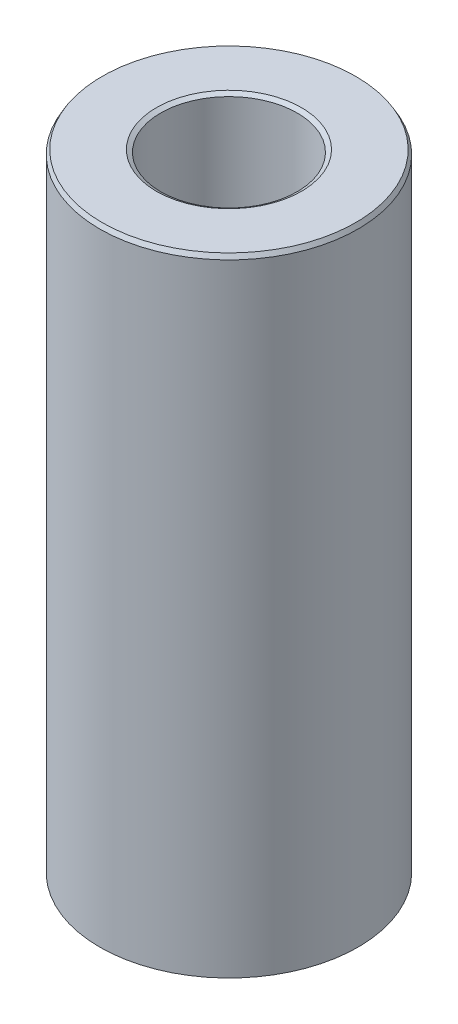
ISO-10303-21;
HEADER;
FILE_DESCRIPTION(('STEP AP214'),'2;1');
FILE_NAME('part.step','',(''),(''),'','','');
FILE_SCHEMA(('AUTOMOTIVE_DESIGN { 1 0 10303 214 1 1 1 1 }'));
ENDSEC;
DATA;
#1=APPLICATION_CONTEXT('core data for automotive mechanical design processes');
#2=APPLICATION_PROTOCOL_DEFINITION('international standard','automotive_design',2000,#1);
#3=PRODUCT_CONTEXT('',#1,'mechanical');
#4=PRODUCT('Part','Part','',(#3));
#5=PRODUCT_RELATED_PRODUCT_CATEGORY('part','',(#4));
#6=PRODUCT_DEFINITION_FORMATION('','',#4);
#7=PRODUCT_DEFINITION_CONTEXT('part definition',#1,'design');
#8=PRODUCT_DEFINITION('design','',#6,#7);
#9=PRODUCT_DEFINITION_SHAPE('','',#8);
#10=(LENGTH_UNIT() NAMED_UNIT(*) SI_UNIT(.MILLI.,.METRE.));
#11=(NAMED_UNIT(*) PLANE_ANGLE_UNIT() SI_UNIT($,.RADIAN.));
#12=(NAMED_UNIT(*) SI_UNIT($,.STERADIAN.) SOLID_ANGLE_UNIT());
#13=UNCERTAINTY_MEASURE_WITH_UNIT(LENGTH_MEASURE(1.E-05),#10,'distance_accuracy_value','');
#14=(GEOMETRIC_REPRESENTATION_CONTEXT(3) GLOBAL_UNCERTAINTY_ASSIGNED_CONTEXT((#13)) GLOBAL_UNIT_ASSIGNED_CONTEXT((#10,
#11,#12)) REPRESENTATION_CONTEXT('',''));
#15=CARTESIAN_POINT('',(0.,0.,0.));
#16=DIRECTION('',(0.,0.,1.));
#17=DIRECTION('',(1.,0.,0.));
#18=AXIS2_PLACEMENT_3D('',#15,#16,#17);
#19=CARTESIAN_POINT('',(0.,85.1411942310435,0.));
#20=DIRECTION('',(0.,-1.,0.));
#21=DIRECTION('',(0.,0.,-1.));
#22=AXIS2_PLACEMENT_3D('',#19,#20,#21);
#23=CYLINDRICAL_SURFACE('',#22,17.5);
#24=CARTESIAN_POINT('',(0.,0.335889421968369,0.));
#25=DIRECTION('',(0.,1.,0.));
#26=DIRECTION('',(0.,0.,1.));
#27=AXIS2_PLACEMENT_3D('',#24,#25,#26);
#28=CIRCLE('',#27,17.5);
#29=CARTESIAN_POINT('',(0.,0.335889421968369,17.5));
#30=VERTEX_POINT('',#29);
#31=EDGE_CURVE('E10',#30,#30,#28,.T.);
#32=ORIENTED_EDGE('',*,*,#31,.T.);
#33=EDGE_LOOP('',(#32));
#34=FACE_BOUND('',#33,.T.);
#35=CARTESIAN_POINT('',(0.,84.5594166864693,0.));
#36=DIRECTION('',(0.,1.,0.));
#37=DIRECTION('',(0.,0.,1.));
#38=AXIS2_PLACEMENT_3D('',#35,#36,#37);
#39=CIRCLE('',#38,17.5);
#40=CARTESIAN_POINT('',(0.,84.5594166864693,17.5));
#41=VERTEX_POINT('',#40);
#42=EDGE_CURVE('E50',#41,#41,#39,.F.);
#43=ORIENTED_EDGE('',*,*,#42,.T.);
#44=EDGE_LOOP('',(#43));
#45=FACE_BOUND('',#44,.T.);
#46=ADVANCED_FACE('F39',(#34,#45),#23,.T.);
#47=CARTESIAN_POINT('',(0.,85.1411942310435,0.));
#48=DIRECTION('',(0.,1.,0.));
#49=DIRECTION('',(0.,0.,1.));
#50=AXIS2_PLACEMENT_3D('',#47,#48,#49);
#51=PLANE('',#50);
#52=CARTESIAN_POINT('',(0.,85.1411942310435,0.));
#53=DIRECTION('',(0.,1.,0.));
#54=DIRECTION('',(0.,0.,1.));
#55=AXIS2_PLACEMENT_3D('',#52,#53,#54);
#56=CIRCLE('',#55,9.82578527081704);
#57=CARTESIAN_POINT('',(0.,85.1411942310435,9.82578527081704));
#58=VERTEX_POINT('',#57);
#59=EDGE_CURVE('E58',#58,#58,#56,.F.);
#60=ORIENTED_EDGE('',*,*,#59,.T.);
#61=EDGE_LOOP('',(#60));
#62=FACE_BOUND('',#61,.T.);
#63=CARTESIAN_POINT('',(0.,85.1411942310435,0.));
#64=DIRECTION('',(0.,1.,0.));
#65=DIRECTION('',(0.,0.,1.));
#66=AXIS2_PLACEMENT_3D('',#63,#64,#65);
#67=CIRCLE('',#66,17.1641105780316);
#68=CARTESIAN_POINT('',(0.,85.1411942310435,17.1641105780316));
#69=VERTEX_POINT('',#68);
#70=EDGE_CURVE('E61',#69,#69,#67,.T.);
#71=ORIENTED_EDGE('',*,*,#70,.T.);
#72=EDGE_LOOP('',(#71));
#73=FACE_BOUND('',#72,.T.);
#74=ADVANCED_FACE('F88',(#62,#73),#51,.T.);
#75=CARTESIAN_POINT('',(0.,0.,0.));
#76=DIRECTION('',(0.,1.,0.));
#77=DIRECTION('',(0.,0.,1.));
#78=AXIS2_PLACEMENT_3D('',#75,#76,#77);
#79=PLANE('',#78);
#80=CARTESIAN_POINT('',(0.,0.,0.));
#81=DIRECTION('',(0.,1.,0.));
#82=DIRECTION('',(0.,0.,1.));
#83=AXIS2_PLACEMENT_3D('',#80,#81,#82);
#84=CIRCLE('',#83,9.57989714821125);
#85=CARTESIAN_POINT('',(0.,0.,9.57989714821125));
#86=VERTEX_POINT('',#85);
#87=EDGE_CURVE('E51',#86,#86,#84,.T.);
#88=ORIENTED_EDGE('',*,*,#87,.T.);
#89=EDGE_LOOP('',(#88));
#90=FACE_BOUND('',#89,.T.);
#91=CARTESIAN_POINT('',(0.,0.,0.));
#92=DIRECTION('',(0.,1.,0.));
#93=DIRECTION('',(0.,0.,1.));
#94=AXIS2_PLACEMENT_3D('',#91,#92,#93);
#95=CIRCLE('',#94,16.9182224554258);
#96=CARTESIAN_POINT('',(0.,0.,16.9182224554258));
#97=VERTEX_POINT('',#96);
#98=EDGE_CURVE('E54',#97,#97,#95,.F.);
#99=ORIENTED_EDGE('',*,*,#98,.T.);
#100=EDGE_LOOP('',(#99));
#101=FACE_BOUND('',#100,.T.);
#102=ADVANCED_FACE('F83',(#90,#101),#79,.F.);
#103=CARTESIAN_POINT('',(0.,85.1411942310435,0.));
#104=DIRECTION('',(0.,-1.,0.));
#105=DIRECTION('',(0.,0.,-1.));
#106=AXIS2_PLACEMENT_3D('',#103,#104,#105);
#107=CYLINDRICAL_SURFACE('',#106,9.24400772624288);
#108=CARTESIAN_POINT('',(0.,84.8053048090751,0.));
#109=DIRECTION('',(0.,1.,0.));
#110=DIRECTION('',(0.,0.,1.));
#111=AXIS2_PLACEMENT_3D('',#108,#109,#110);
#112=CIRCLE('',#111,9.24400772624288);
#113=CARTESIAN_POINT('',(0.,84.8053048090751,9.24400772624288));
#114=VERTEX_POINT('',#113);
#115=EDGE_CURVE('E67',#114,#114,#112,.T.);
#116=ORIENTED_EDGE('',*,*,#115,.T.);
#117=EDGE_LOOP('',(#116));
#118=FACE_BOUND('',#117,.T.);
#119=CARTESIAN_POINT('',(0.,0.581777544574169,0.));
#120=DIRECTION('',(0.,1.,0.));
#121=DIRECTION('',(0.,0.,1.));
#122=AXIS2_PLACEMENT_3D('',#119,#120,#121);
#123=CIRCLE('',#122,9.24400772624288);
#124=CARTESIAN_POINT('',(0.,0.581777544574169,9.24400772624288));
#125=VERTEX_POINT('',#124);
#126=EDGE_CURVE('E69',#125,#125,#123,.F.);
#127=ORIENTED_EDGE('',*,*,#126,.T.);
#128=EDGE_LOOP('',(#127));
#129=FACE_BOUND('',#128,.T.);
#130=ADVANCED_FACE('F71',(#118,#129),#107,.F.);
#131=CARTESIAN_POINT('',(0.,84.8053048090751,0.));
#132=DIRECTION('',(0.,1.,0.));
#133=DIRECTION('',(0.,0.,1.));
#134=AXIS2_PLACEMENT_3D('',#131,#132,#133);
#135=CONICAL_SURFACE('',#134,9.24400772624288,1.0471975511966);
#136=ORIENTED_EDGE('',*,*,#59,.F.);
#137=EDGE_LOOP('',(#136));
#138=FACE_BOUND('',#137,.T.);
#139=ORIENTED_EDGE('',*,*,#115,.F.);
#140=EDGE_LOOP('',(#139));
#141=FACE_BOUND('',#140,.T.);
#142=ADVANCED_FACE('F77',(#138,#141),#135,.F.);
#143=CARTESIAN_POINT('',(0.,0.,0.));
#144=DIRECTION('',(0.,-1.,0.));
#145=DIRECTION('',(0.,0.,-1.));
#146=AXIS2_PLACEMENT_3D('',#143,#144,#145);
#147=CONICAL_SURFACE('',#146,9.57989714821125,0.523598775598294);
#148=ORIENTED_EDGE('',*,*,#126,.F.);
#149=EDGE_LOOP('',(#148));
#150=FACE_BOUND('',#149,.T.);
#151=ORIENTED_EDGE('',*,*,#87,.F.);
#152=EDGE_LOOP('',(#151));
#153=FACE_BOUND('',#152,.T.);
#154=ADVANCED_FACE('F73',(#150,#153),#147,.F.);
#155=CARTESIAN_POINT('',(0.,0.335889421968369,0.));
#156=DIRECTION('',(0.,1.,0.));
#157=DIRECTION('',(0.,0.,1.));
#158=AXIS2_PLACEMENT_3D('',#155,#156,#157);
#159=CONICAL_SURFACE('',#158,17.5,1.04719755119661);
#160=ORIENTED_EDGE('',*,*,#98,.F.);
#161=EDGE_LOOP('',(#160));
#162=FACE_BOUND('',#161,.T.);
#163=ORIENTED_EDGE('',*,*,#31,.F.);
#164=EDGE_LOOP('',(#163));
#165=FACE_BOUND('',#164,.T.);
#166=ADVANCED_FACE('F76',(#162,#165),#159,.T.);
#167=CARTESIAN_POINT('',(0.,85.1411942310435,0.));
#168=DIRECTION('',(0.,-1.,0.));
#169=DIRECTION('',(0.,0.,-1.));
#170=AXIS2_PLACEMENT_3D('',#167,#168,#169);
#171=CONICAL_SURFACE('',#170,17.1641105780316,0.523598775598276);
#172=ORIENTED_EDGE('',*,*,#42,.F.);
#173=EDGE_LOOP('',(#172));
#174=FACE_BOUND('',#173,.T.);
#175=ORIENTED_EDGE('',*,*,#70,.F.);
#176=EDGE_LOOP('',(#175));
#177=FACE_BOUND('',#176,.T.);
#178=ADVANCED_FACE('F45',(#174,#177),#171,.T.);
#179=CLOSED_SHELL('',(#46,#74,#102,#130,#142,#154,#166,#178));
#180=MANIFOLD_SOLID_BREP('B2',#179);
#181=ADVANCED_BREP_SHAPE_REPRESENTATION('',(#18,#180),#14);
#182=SHAPE_DEFINITION_REPRESENTATION(#9,#181);
ENDSEC;
END-ISO-10303-21;
